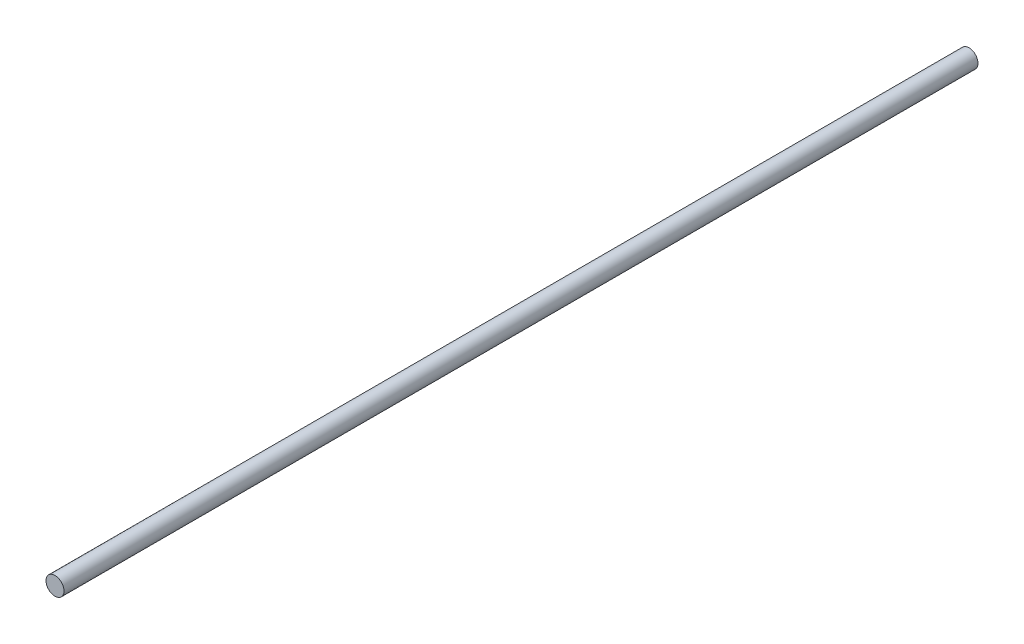
ISO-10303-21;
HEADER;
FILE_DESCRIPTION(('STEP AP214'),'2;1');
FILE_NAME('part.step','',(''),(''),'','','');
FILE_SCHEMA(('AUTOMOTIVE_DESIGN { 1 0 10303 214 1 1 1 1 }'));
ENDSEC;
DATA;
#1=APPLICATION_CONTEXT('core data for automotive mechanical design processes');
#2=APPLICATION_PROTOCOL_DEFINITION('international standard','automotive_design',2000,#1);
#3=PRODUCT_CONTEXT('',#1,'mechanical');
#4=PRODUCT('Part','Part','',(#3));
#5=PRODUCT_RELATED_PRODUCT_CATEGORY('part','',(#4));
#6=PRODUCT_DEFINITION_FORMATION('','',#4);
#7=PRODUCT_DEFINITION_CONTEXT('part definition',#1,'design');
#8=PRODUCT_DEFINITION('design','',#6,#7);
#9=PRODUCT_DEFINITION_SHAPE('','',#8);
#10=(LENGTH_UNIT() NAMED_UNIT(*) SI_UNIT(.MILLI.,.METRE.));
#11=(NAMED_UNIT(*) PLANE_ANGLE_UNIT() SI_UNIT($,.RADIAN.));
#12=(NAMED_UNIT(*) SI_UNIT($,.STERADIAN.) SOLID_ANGLE_UNIT());
#13=UNCERTAINTY_MEASURE_WITH_UNIT(LENGTH_MEASURE(1.E-05),#10,'distance_accuracy_value','');
#14=(GEOMETRIC_REPRESENTATION_CONTEXT(3) GLOBAL_UNCERTAINTY_ASSIGNED_CONTEXT((#13)) GLOBAL_UNIT_ASSIGNED_CONTEXT((#10,
#11,#12)) REPRESENTATION_CONTEXT('',''));
#15=CARTESIAN_POINT('',(0.,0.,0.));
#16=DIRECTION('',(0.,0.,1.));
#17=DIRECTION('',(1.,0.,0.));
#18=AXIS2_PLACEMENT_3D('',#15,#16,#17);
#19=CARTESIAN_POINT('',(6.99961382391329,4.80309765097742,-406.));
#20=DIRECTION('',(0.,0.,1.));
#21=DIRECTION('',(1.,0.,0.));
#22=AXIS2_PLACEMENT_3D('',#19,#20,#21);
#23=CYLINDRICAL_SURFACE('',#22,4.);
#24=CARTESIAN_POINT('',(6.99961382391329,4.80309765097742,-406.));
#25=DIRECTION('',(0.,0.,1.));
#26=DIRECTION('',(1.,0.,0.));
#27=AXIS2_PLACEMENT_3D('',#24,#25,#26);
#28=CIRCLE('',#27,4.);
#29=CARTESIAN_POINT('',(10.9996138239133,4.80309765097741,-406.));
#30=VERTEX_POINT('',#29);
#31=EDGE_CURVE('E10',#30,#30,#28,.T.);
#32=ORIENTED_EDGE('',*,*,#31,.T.);
#33=EDGE_LOOP('',(#32));
#34=FACE_BOUND('',#33,.T.);
#35=CARTESIAN_POINT('',(6.99961382391057,4.80309765097742,0.));
#36=DIRECTION('',(0.,0.,1.));
#37=DIRECTION('',(1.,0.,0.));
#38=AXIS2_PLACEMENT_3D('',#35,#36,#37);
#39=CIRCLE('',#38,4.);
#40=CARTESIAN_POINT('',(10.9996138239106,4.80309765097741,0.));
#41=VERTEX_POINT('',#40);
#42=EDGE_CURVE('E33',#41,#41,#39,.T.);
#43=ORIENTED_EDGE('',*,*,#42,.F.);
#44=EDGE_LOOP('',(#43));
#45=FACE_BOUND('',#44,.T.);
#46=ADVANCED_FACE('F30',(#34,#45),#23,.T.);
#47=CARTESIAN_POINT('',(6.99961382391329,4.80309765097742,-406.));
#48=DIRECTION('',(0.,0.,1.));
#49=DIRECTION('',(1.,0.,0.));
#50=AXIS2_PLACEMENT_3D('',#47,#48,#49);
#51=PLANE('',#50);
#52=ORIENTED_EDGE('',*,*,#31,.F.);
#53=EDGE_LOOP('',(#52));
#54=FACE_BOUND('',#53,.T.);
#55=ADVANCED_FACE('F45',(#54),#51,.F.);
#56=CARTESIAN_POINT('',(6.99961382391057,4.80309765097742,0.));
#57=DIRECTION('',(0.,0.,1.));
#58=DIRECTION('',(1.,0.,0.));
#59=AXIS2_PLACEMENT_3D('',#56,#57,#58);
#60=PLANE('',#59);
#61=ORIENTED_EDGE('',*,*,#42,.T.);
#62=EDGE_LOOP('',(#61));
#63=FACE_BOUND('',#62,.T.);
#64=ADVANCED_FACE('F42',(#63),#60,.T.);
#65=CLOSED_SHELL('',(#46,#55,#64));
#66=MANIFOLD_SOLID_BREP('B2',#65);
#67=ADVANCED_BREP_SHAPE_REPRESENTATION('',(#18,#66),#14);
#68=SHAPE_DEFINITION_REPRESENTATION(#9,#67);
ENDSEC;
END-ISO-10303-21;
